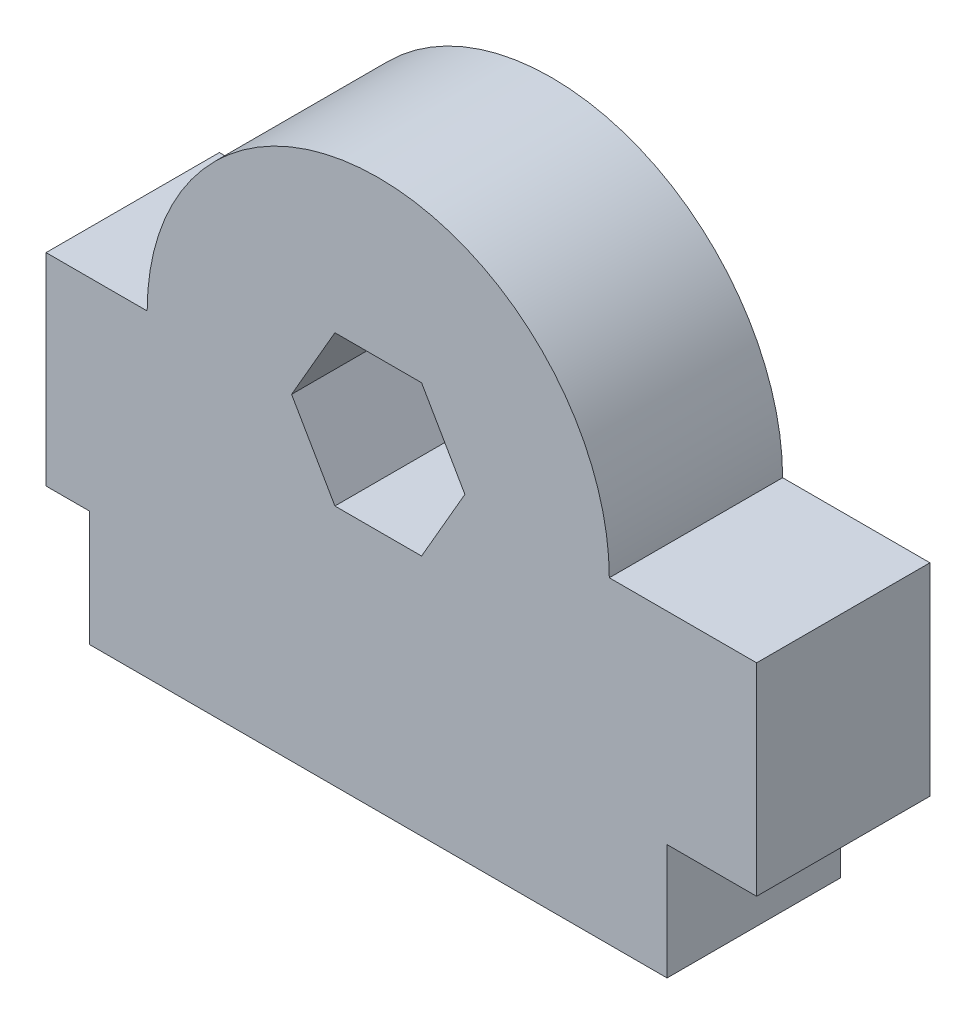
ISO-10303-21;
HEADER;
FILE_DESCRIPTION(('STEP AP214'),'2;1');
FILE_NAME('part.step','',(''),(''),'','','');
FILE_SCHEMA(('AUTOMOTIVE_DESIGN { 1 0 10303 214 1 1 1 1 }'));
ENDSEC;
DATA;
#1=APPLICATION_CONTEXT('core data for automotive mechanical design processes');
#2=APPLICATION_PROTOCOL_DEFINITION('international standard','automotive_design',2000,#1);
#3=PRODUCT_CONTEXT('',#1,'mechanical');
#4=PRODUCT('Part','Part','',(#3));
#5=PRODUCT_RELATED_PRODUCT_CATEGORY('part','',(#4));
#6=PRODUCT_DEFINITION_FORMATION('','',#4);
#7=PRODUCT_DEFINITION_CONTEXT('part definition',#1,'design');
#8=PRODUCT_DEFINITION('design','',#6,#7);
#9=PRODUCT_DEFINITION_SHAPE('','',#8);
#10=(LENGTH_UNIT() NAMED_UNIT(*) SI_UNIT(.MILLI.,.METRE.));
#11=(NAMED_UNIT(*) PLANE_ANGLE_UNIT() SI_UNIT($,.RADIAN.));
#12=(NAMED_UNIT(*) SI_UNIT($,.STERADIAN.) SOLID_ANGLE_UNIT());
#13=UNCERTAINTY_MEASURE_WITH_UNIT(LENGTH_MEASURE(1.E-05),#10,'distance_accuracy_value','');
#14=(GEOMETRIC_REPRESENTATION_CONTEXT(3) GLOBAL_UNCERTAINTY_ASSIGNED_CONTEXT((#13)) GLOBAL_UNIT_ASSIGNED_CONTEXT((#10,
#11,#12)) REPRESENTATION_CONTEXT('',''));
#15=CARTESIAN_POINT('',(0.,0.,0.));
#16=DIRECTION('',(0.,0.,1.));
#17=DIRECTION('',(1.,0.,0.));
#18=AXIS2_PLACEMENT_3D('',#15,#16,#17);
#19=CARTESIAN_POINT('',(10.,11.,6.));
#20=DIRECTION('',(0.,0.,1.));
#21=DIRECTION('',(1.,0.,0.));
#22=AXIS2_PLACEMENT_3D('',#19,#20,#21);
#23=PLANE('',#22);
#24=DIRECTION('',(0.,-1.,0.));
#25=VECTOR('',#24,1.);
#26=CARTESIAN_POINT('',(0.,0.,6.));
#27=LINE('',#26,#25);
#28=CARTESIAN_POINT('',(0.,4.,6.));
#29=VERTEX_POINT('',#28);
#30=CARTESIAN_POINT('',(0.,0.,6.));
#31=VERTEX_POINT('',#30);
#32=EDGE_CURVE('E197',#29,#31,#27,.T.);
#33=ORIENTED_EDGE('',*,*,#32,.T.);
#34=DIRECTION('',(1.,0.,0.));
#35=VECTOR('',#34,1.);
#36=CARTESIAN_POINT('',(0.,0.,6.));
#37=LINE('',#36,#35);
#38=CARTESIAN_POINT('',(20.,0.,6.));
#39=VERTEX_POINT('',#38);
#40=EDGE_CURVE('E200',#31,#39,#37,.T.);
#41=ORIENTED_EDGE('',*,*,#40,.T.);
#42=DIRECTION('',(0.,1.,0.));
#43=VECTOR('',#42,1.);
#44=CARTESIAN_POINT('',(20.,0.,6.));
#45=LINE('',#44,#43);
#46=CARTESIAN_POINT('',(20.,4.,6.));
#47=VERTEX_POINT('',#46);
#48=EDGE_CURVE('E203',#39,#47,#45,.T.);
#49=ORIENTED_EDGE('',*,*,#48,.T.);
#50=DIRECTION('',(1.,0.,0.));
#51=VECTOR('',#50,1.);
#52=CARTESIAN_POINT('',(23.1,4.,6.));
#53=LINE('',#52,#51);
#54=CARTESIAN_POINT('',(23.1,4.,6.));
#55=VERTEX_POINT('',#54);
#56=EDGE_CURVE('E205',#47,#55,#53,.T.);
#57=ORIENTED_EDGE('',*,*,#56,.T.);
#58=DIRECTION('',(0.,1.,0.));
#59=VECTOR('',#58,1.);
#60=CARTESIAN_POINT('',(23.1,11.,6.));
#61=LINE('',#60,#59);
#62=CARTESIAN_POINT('',(23.1,11.,6.));
#63=VERTEX_POINT('',#62);
#64=EDGE_CURVE('E207',#55,#63,#61,.T.);
#65=ORIENTED_EDGE('',*,*,#64,.T.);
#66=DIRECTION('',(-1.,0.,0.));
#67=VECTOR('',#66,1.);
#68=CARTESIAN_POINT('',(18.,11.,6.));
#69=LINE('',#68,#67);
#70=CARTESIAN_POINT('',(18.,11.,6.));
#71=VERTEX_POINT('',#70);
#72=EDGE_CURVE('E209',#63,#71,#69,.T.);
#73=ORIENTED_EDGE('',*,*,#72,.T.);
#74=CARTESIAN_POINT('',(10.,11.,6.));
#75=DIRECTION('',(0.,0.,1.));
#76=DIRECTION('',(1.,0.,0.));
#77=AXIS2_PLACEMENT_3D('',#74,#75,#76);
#78=CIRCLE('',#77,8.);
#79=CARTESIAN_POINT('',(2.,11.,6.));
#80=VERTEX_POINT('',#79);
#81=EDGE_CURVE('E211',#71,#80,#78,.T.);
#82=ORIENTED_EDGE('',*,*,#81,.T.);
#83=DIRECTION('',(-1.,0.,0.));
#84=VECTOR('',#83,1.);
#85=CARTESIAN_POINT('',(-1.5,11.,6.));
#86=LINE('',#85,#84);
#87=CARTESIAN_POINT('',(-1.5,11.,6.));
#88=VERTEX_POINT('',#87);
#89=EDGE_CURVE('E213',#80,#88,#86,.T.);
#90=ORIENTED_EDGE('',*,*,#89,.T.);
#91=DIRECTION('',(0.,-1.,0.));
#92=VECTOR('',#91,1.);
#93=CARTESIAN_POINT('',(-1.5,4.,6.));
#94=LINE('',#93,#92);
#95=CARTESIAN_POINT('',(-1.5,4.,6.));
#96=VERTEX_POINT('',#95);
#97=EDGE_CURVE('E215',#88,#96,#94,.T.);
#98=ORIENTED_EDGE('',*,*,#97,.T.);
#99=DIRECTION('',(1.,0.,0.));
#100=VECTOR('',#99,1.);
#101=CARTESIAN_POINT('',(0.,4.,6.));
#102=LINE('',#101,#100);
#103=EDGE_CURVE('E217',#96,#29,#102,.T.);
#104=ORIENTED_EDGE('',*,*,#103,.T.);
#105=EDGE_LOOP('',(#33,#41,#49,#57,#65,#73,#82,#90,#98,#104));
#106=FACE_BOUND('',#105,.T.);
#107=DIRECTION('',(-0.500000000000001,0.866025403784438,0.));
#108=VECTOR('',#107,1.);
#109=CARTESIAN_POINT('',(13.,11.,6.));
#110=LINE('',#109,#108);
#111=CARTESIAN_POINT('',(13.,11.,6.));
#112=VERTEX_POINT('',#111);
#113=CARTESIAN_POINT('',(11.5,13.5980762113533,6.));
#114=VERTEX_POINT('',#113);
#115=EDGE_CURVE('E154',#112,#114,#110,.T.);
#116=ORIENTED_EDGE('',*,*,#115,.F.);
#117=DIRECTION('',(0.499999999999995,0.866025403784441,0.));
#118=VECTOR('',#117,1.);
#119=CARTESIAN_POINT('',(11.5,8.4019237886467,6.));
#120=LINE('',#119,#118);
#121=CARTESIAN_POINT('',(11.5,8.4019237886467,6.));
#122=VERTEX_POINT('',#121);
#123=EDGE_CURVE('E146',#122,#112,#120,.T.);
#124=ORIENTED_EDGE('',*,*,#123,.F.);
#125=DIRECTION('',(1.,0.,0.));
#126=VECTOR('',#125,1.);
#127=CARTESIAN_POINT('',(8.50000000000002,8.40192378864667,6.));
#128=LINE('',#127,#126);
#129=CARTESIAN_POINT('',(8.50000000000002,8.40192378864667,6.));
#130=VERTEX_POINT('',#129);
#131=EDGE_CURVE('E175',#130,#122,#128,.T.);
#132=ORIENTED_EDGE('',*,*,#131,.F.);
#133=DIRECTION('',(0.500000000000007,-0.866025403784435,0.));
#134=VECTOR('',#133,1.);
#135=CARTESIAN_POINT('',(7.,11.,6.));
#136=LINE('',#135,#134);
#137=CARTESIAN_POINT('',(7.,11.,6.));
#138=VERTEX_POINT('',#137);
#139=EDGE_CURVE('E173',#138,#130,#136,.T.);
#140=ORIENTED_EDGE('',*,*,#139,.F.);
#141=DIRECTION('',(-0.499999999999995,-0.866025403784441,0.));
#142=VECTOR('',#141,1.);
#143=CARTESIAN_POINT('',(8.49999999999999,13.5980762113533,6.));
#144=LINE('',#143,#142);
#145=CARTESIAN_POINT('',(8.49999999999999,13.5980762113533,6.));
#146=VERTEX_POINT('',#145);
#147=EDGE_CURVE('E169',#146,#138,#144,.T.);
#148=ORIENTED_EDGE('',*,*,#147,.F.);
#149=DIRECTION('',(-1.,0.,0.));
#150=VECTOR('',#149,1.);
#151=CARTESIAN_POINT('',(11.5,13.5980762113533,6.));
#152=LINE('',#151,#150);
#153=EDGE_CURVE('E167',#114,#146,#152,.T.);
#154=ORIENTED_EDGE('',*,*,#153,.F.);
#155=EDGE_LOOP('',(#116,#124,#132,#140,#148,#154));
#156=FACE_BOUND('',#155,.T.);
#157=ADVANCED_FACE('F33',(#106,#156),#23,.T.);
#158=CARTESIAN_POINT('',(10.,11.,0.));
#159=DIRECTION('',(0.,0.,1.));
#160=DIRECTION('',(1.,0.,0.));
#161=AXIS2_PLACEMENT_3D('',#158,#159,#160);
#162=PLANE('',#161);
#163=DIRECTION('',(0.,-1.,0.));
#164=VECTOR('',#163,1.);
#165=CARTESIAN_POINT('',(0.,0.,0.));
#166=LINE('',#165,#164);
#167=CARTESIAN_POINT('',(0.,4.,0.));
#168=VERTEX_POINT('',#167);
#169=CARTESIAN_POINT('',(0.,0.,0.));
#170=VERTEX_POINT('',#169);
#171=EDGE_CURVE('E162',#168,#170,#166,.T.);
#172=ORIENTED_EDGE('',*,*,#171,.F.);
#173=DIRECTION('',(1.,0.,0.));
#174=VECTOR('',#173,1.);
#175=CARTESIAN_POINT('',(0.,4.,0.));
#176=LINE('',#175,#174);
#177=CARTESIAN_POINT('',(-1.5,4.,0.));
#178=VERTEX_POINT('',#177);
#179=EDGE_CURVE('E201',#178,#168,#176,.T.);
#180=ORIENTED_EDGE('',*,*,#179,.F.);
#181=DIRECTION('',(0.,-1.,0.));
#182=VECTOR('',#181,1.);
#183=CARTESIAN_POINT('',(-1.5,4.,0.));
#184=LINE('',#183,#182);
#185=CARTESIAN_POINT('',(-1.5,11.,0.));
#186=VERTEX_POINT('',#185);
#187=EDGE_CURVE('E236',#186,#178,#184,.T.);
#188=ORIENTED_EDGE('',*,*,#187,.F.);
#189=DIRECTION('',(-1.,0.,0.));
#190=VECTOR('',#189,1.);
#191=CARTESIAN_POINT('',(-1.5,11.,0.));
#192=LINE('',#191,#190);
#193=CARTESIAN_POINT('',(2.,11.,0.));
#194=VERTEX_POINT('',#193);
#195=EDGE_CURVE('E234',#194,#186,#192,.T.);
#196=ORIENTED_EDGE('',*,*,#195,.F.);
#197=CARTESIAN_POINT('',(10.,11.,0.));
#198=DIRECTION('',(0.,0.,1.));
#199=DIRECTION('',(1.,0.,0.));
#200=AXIS2_PLACEMENT_3D('',#197,#198,#199);
#201=CIRCLE('',#200,8.);
#202=CARTESIAN_POINT('',(18.,11.,0.));
#203=VERTEX_POINT('',#202);
#204=EDGE_CURVE('E232',#203,#194,#201,.T.);
#205=ORIENTED_EDGE('',*,*,#204,.F.);
#206=DIRECTION('',(-1.,0.,0.));
#207=VECTOR('',#206,1.);
#208=CARTESIAN_POINT('',(18.,11.,0.));
#209=LINE('',#208,#207);
#210=CARTESIAN_POINT('',(23.1,11.,0.));
#211=VERTEX_POINT('',#210);
#212=EDGE_CURVE('E230',#211,#203,#209,.T.);
#213=ORIENTED_EDGE('',*,*,#212,.F.);
#214=DIRECTION('',(0.,1.,0.));
#215=VECTOR('',#214,1.);
#216=CARTESIAN_POINT('',(23.1,11.,0.));
#217=LINE('',#216,#215);
#218=CARTESIAN_POINT('',(23.1,4.,0.));
#219=VERTEX_POINT('',#218);
#220=EDGE_CURVE('E228',#219,#211,#217,.T.);
#221=ORIENTED_EDGE('',*,*,#220,.F.);
#222=DIRECTION('',(1.,0.,0.));
#223=VECTOR('',#222,1.);
#224=CARTESIAN_POINT('',(23.1,4.,0.));
#225=LINE('',#224,#223);
#226=CARTESIAN_POINT('',(20.,4.,0.));
#227=VERTEX_POINT('',#226);
#228=EDGE_CURVE('E226',#227,#219,#225,.T.);
#229=ORIENTED_EDGE('',*,*,#228,.F.);
#230=DIRECTION('',(0.,1.,0.));
#231=VECTOR('',#230,1.);
#232=CARTESIAN_POINT('',(20.,0.,0.));
#233=LINE('',#232,#231);
#234=CARTESIAN_POINT('',(20.,0.,0.));
#235=VERTEX_POINT('',#234);
#236=EDGE_CURVE('E224',#235,#227,#233,.T.);
#237=ORIENTED_EDGE('',*,*,#236,.F.);
#238=DIRECTION('',(1.,0.,0.));
#239=VECTOR('',#238,1.);
#240=CARTESIAN_POINT('',(0.,0.,0.));
#241=LINE('',#240,#239);
#242=EDGE_CURVE('E222',#170,#235,#241,.T.);
#243=ORIENTED_EDGE('',*,*,#242,.F.);
#244=EDGE_LOOP('',(#172,#180,#188,#196,#205,#213,#221,#229,#237,#243));
#245=FACE_BOUND('',#244,.T.);
#246=DIRECTION('',(0.499999999999995,0.866025403784441,0.));
#247=VECTOR('',#246,1.);
#248=CARTESIAN_POINT('',(11.5,8.4019237886467,0.));
#249=LINE('',#248,#247);
#250=CARTESIAN_POINT('',(11.5,8.4019237886467,0.));
#251=VERTEX_POINT('',#250);
#252=CARTESIAN_POINT('',(13.,11.,0.));
#253=VERTEX_POINT('',#252);
#254=EDGE_CURVE('E56',#251,#253,#249,.T.);
#255=ORIENTED_EDGE('',*,*,#254,.T.);
#256=DIRECTION('',(-0.500000000000001,0.866025403784438,0.));
#257=VECTOR('',#256,1.);
#258=CARTESIAN_POINT('',(13.,11.,0.));
#259=LINE('',#258,#257);
#260=CARTESIAN_POINT('',(11.5,13.5980762113533,0.));
#261=VERTEX_POINT('',#260);
#262=EDGE_CURVE('E161',#253,#261,#259,.T.);
#263=ORIENTED_EDGE('',*,*,#262,.T.);
#264=DIRECTION('',(-1.,0.,0.));
#265=VECTOR('',#264,1.);
#266=CARTESIAN_POINT('',(11.5,13.5980762113533,0.));
#267=LINE('',#266,#265);
#268=CARTESIAN_POINT('',(8.49999999999999,13.5980762113533,0.));
#269=VERTEX_POINT('',#268);
#270=EDGE_CURVE('E179',#261,#269,#267,.T.);
#271=ORIENTED_EDGE('',*,*,#270,.T.);
#272=DIRECTION('',(-0.499999999999995,-0.866025403784441,0.));
#273=VECTOR('',#272,1.);
#274=CARTESIAN_POINT('',(8.49999999999999,13.5980762113533,0.));
#275=LINE('',#274,#273);
#276=CARTESIAN_POINT('',(7.,11.,0.));
#277=VERTEX_POINT('',#276);
#278=EDGE_CURVE('E182',#269,#277,#275,.T.);
#279=ORIENTED_EDGE('',*,*,#278,.T.);
#280=DIRECTION('',(0.500000000000007,-0.866025403784435,0.));
#281=VECTOR('',#280,1.);
#282=CARTESIAN_POINT('',(7.,11.,0.));
#283=LINE('',#282,#281);
#284=CARTESIAN_POINT('',(8.50000000000002,8.40192378864667,0.));
#285=VERTEX_POINT('',#284);
#286=EDGE_CURVE('E185',#277,#285,#283,.T.);
#287=ORIENTED_EDGE('',*,*,#286,.T.);
#288=DIRECTION('',(1.,0.,0.));
#289=VECTOR('',#288,1.);
#290=CARTESIAN_POINT('',(8.50000000000002,8.40192378864667,0.));
#291=LINE('',#290,#289);
#292=EDGE_CURVE('E155',#285,#251,#291,.T.);
#293=ORIENTED_EDGE('',*,*,#292,.T.);
#294=EDGE_LOOP('',(#255,#263,#271,#279,#287,#293));
#295=FACE_BOUND('',#294,.T.);
#296=ADVANCED_FACE('F272',(#245,#295),#162,.F.);
#297=CARTESIAN_POINT('',(0.,0.,6.));
#298=DIRECTION('',(1.,0.,0.));
#299=DIRECTION('',(0.,0.,-1.));
#300=AXIS2_PLACEMENT_3D('',#297,#298,#299);
#301=PLANE('',#300);
#302=ORIENTED_EDGE('',*,*,#171,.T.);
#303=DIRECTION('',(0.,0.,-1.));
#304=VECTOR('',#303,1.);
#305=CARTESIAN_POINT('',(0.,0.,6.));
#306=LINE('',#305,#304);
#307=EDGE_CURVE('E11',#31,#170,#306,.T.);
#308=ORIENTED_EDGE('',*,*,#307,.F.);
#309=ORIENTED_EDGE('',*,*,#32,.F.);
#310=DIRECTION('',(0.,0.,-1.));
#311=VECTOR('',#310,1.);
#312=CARTESIAN_POINT('',(0.,4.,6.));
#313=LINE('',#312,#311);
#314=EDGE_CURVE('E219',#29,#168,#313,.T.);
#315=ORIENTED_EDGE('',*,*,#314,.T.);
#316=EDGE_LOOP('',(#302,#308,#309,#315));
#317=FACE_BOUND('',#316,.T.);
#318=ADVANCED_FACE('F35',(#317),#301,.F.);
#319=CARTESIAN_POINT('',(0.,0.,6.));
#320=DIRECTION('',(0.,1.,0.));
#321=DIRECTION('',(0.,0.,1.));
#322=AXIS2_PLACEMENT_3D('',#319,#320,#321);
#323=PLANE('',#322);
#324=ORIENTED_EDGE('',*,*,#242,.T.);
#325=DIRECTION('',(0.,0.,-1.));
#326=VECTOR('',#325,1.);
#327=CARTESIAN_POINT('',(20.,0.,6.));
#328=LINE('',#327,#326);
#329=EDGE_CURVE('E41',#39,#235,#328,.T.);
#330=ORIENTED_EDGE('',*,*,#329,.F.);
#331=ORIENTED_EDGE('',*,*,#40,.F.);
#332=ORIENTED_EDGE('',*,*,#307,.T.);
#333=EDGE_LOOP('',(#324,#330,#331,#332));
#334=FACE_BOUND('',#333,.T.);
#335=ADVANCED_FACE('F289',(#334),#323,.F.);
#336=CARTESIAN_POINT('',(20.,0.,6.));
#337=DIRECTION('',(-1.,0.,0.));
#338=DIRECTION('',(0.,0.,1.));
#339=AXIS2_PLACEMENT_3D('',#336,#337,#338);
#340=PLANE('',#339);
#341=ORIENTED_EDGE('',*,*,#236,.T.);
#342=DIRECTION('',(0.,0.,-1.));
#343=VECTOR('',#342,1.);
#344=CARTESIAN_POINT('',(20.,4.,6.));
#345=LINE('',#344,#343);
#346=EDGE_CURVE('E259',#47,#227,#345,.T.);
#347=ORIENTED_EDGE('',*,*,#346,.F.);
#348=ORIENTED_EDGE('',*,*,#48,.F.);
#349=ORIENTED_EDGE('',*,*,#329,.T.);
#350=EDGE_LOOP('',(#341,#347,#348,#349));
#351=FACE_BOUND('',#350,.T.);
#352=ADVANCED_FACE('F266',(#351),#340,.F.);
#353=CARTESIAN_POINT('',(23.1,4.,6.));
#354=DIRECTION('',(0.,1.,0.));
#355=DIRECTION('',(-1.,0.,0.));
#356=AXIS2_PLACEMENT_3D('',#353,#354,#355);
#357=PLANE('',#356);
#358=ORIENTED_EDGE('',*,*,#228,.T.);
#359=DIRECTION('',(0.,0.,-1.));
#360=VECTOR('',#359,1.);
#361=CARTESIAN_POINT('',(23.1,4.,6.));
#362=LINE('',#361,#360);
#363=EDGE_CURVE('E256',#55,#219,#362,.T.);
#364=ORIENTED_EDGE('',*,*,#363,.F.);
#365=ORIENTED_EDGE('',*,*,#56,.F.);
#366=ORIENTED_EDGE('',*,*,#346,.T.);
#367=EDGE_LOOP('',(#358,#364,#365,#366));
#368=FACE_BOUND('',#367,.T.);
#369=ADVANCED_FACE('F278',(#368),#357,.F.);
#370=CARTESIAN_POINT('',(23.1,11.,6.));
#371=DIRECTION('',(-1.,0.,0.));
#372=DIRECTION('',(0.,0.,1.));
#373=AXIS2_PLACEMENT_3D('',#370,#371,#372);
#374=PLANE('',#373);
#375=ORIENTED_EDGE('',*,*,#220,.T.);
#376=DIRECTION('',(0.,0.,-1.));
#377=VECTOR('',#376,1.);
#378=CARTESIAN_POINT('',(23.1,11.,6.));
#379=LINE('',#378,#377);
#380=EDGE_CURVE('E253',#63,#211,#379,.T.);
#381=ORIENTED_EDGE('',*,*,#380,.F.);
#382=ORIENTED_EDGE('',*,*,#64,.F.);
#383=ORIENTED_EDGE('',*,*,#363,.T.);
#384=EDGE_LOOP('',(#375,#381,#382,#383));
#385=FACE_BOUND('',#384,.T.);
#386=ADVANCED_FACE('F282',(#385),#374,.F.);
#387=CARTESIAN_POINT('',(18.,11.,6.));
#388=DIRECTION('',(0.,-1.,0.));
#389=DIRECTION('',(1.,0.,0.));
#390=AXIS2_PLACEMENT_3D('',#387,#388,#389);
#391=PLANE('',#390);
#392=ORIENTED_EDGE('',*,*,#212,.T.);
#393=DIRECTION('',(0.,0.,-1.));
#394=VECTOR('',#393,1.);
#395=CARTESIAN_POINT('',(18.,11.,6.));
#396=LINE('',#395,#394);
#397=EDGE_CURVE('E250',#71,#203,#396,.T.);
#398=ORIENTED_EDGE('',*,*,#397,.F.);
#399=ORIENTED_EDGE('',*,*,#72,.F.);
#400=ORIENTED_EDGE('',*,*,#380,.T.);
#401=EDGE_LOOP('',(#392,#398,#399,#400));
#402=FACE_BOUND('',#401,.T.);
#403=ADVANCED_FACE('F312',(#402),#391,.F.);
#404=CARTESIAN_POINT('',(10.,11.,6.));
#405=DIRECTION('',(0.,0.,-1.));
#406=DIRECTION('',(-1.,0.,0.));
#407=AXIS2_PLACEMENT_3D('',#404,#405,#406);
#408=CYLINDRICAL_SURFACE('',#407,8.);
#409=ORIENTED_EDGE('',*,*,#204,.T.);
#410=DIRECTION('',(0.,0.,-1.));
#411=VECTOR('',#410,1.);
#412=CARTESIAN_POINT('',(2.,11.,6.));
#413=LINE('',#412,#411);
#414=EDGE_CURVE('E247',#80,#194,#413,.T.);
#415=ORIENTED_EDGE('',*,*,#414,.F.);
#416=ORIENTED_EDGE('',*,*,#81,.F.);
#417=ORIENTED_EDGE('',*,*,#397,.T.);
#418=EDGE_LOOP('',(#409,#415,#416,#417));
#419=FACE_BOUND('',#418,.T.);
#420=ADVANCED_FACE('F309',(#419),#408,.T.);
#421=CARTESIAN_POINT('',(-1.5,11.,6.));
#422=DIRECTION('',(0.,-1.,0.));
#423=DIRECTION('',(0.,0.,-1.));
#424=AXIS2_PLACEMENT_3D('',#421,#422,#423);
#425=PLANE('',#424);
#426=ORIENTED_EDGE('',*,*,#195,.T.);
#427=DIRECTION('',(0.,0.,-1.));
#428=VECTOR('',#427,1.);
#429=CARTESIAN_POINT('',(-1.5,11.,6.));
#430=LINE('',#429,#428);
#431=EDGE_CURVE('E244',#88,#186,#430,.T.);
#432=ORIENTED_EDGE('',*,*,#431,.F.);
#433=ORIENTED_EDGE('',*,*,#89,.F.);
#434=ORIENTED_EDGE('',*,*,#414,.T.);
#435=EDGE_LOOP('',(#426,#432,#433,#434));
#436=FACE_BOUND('',#435,.T.);
#437=ADVANCED_FACE('F305',(#436),#425,.F.);
#438=CARTESIAN_POINT('',(-1.5,4.,6.));
#439=DIRECTION('',(1.,0.,0.));
#440=DIRECTION('',(0.,0.,-1.));
#441=AXIS2_PLACEMENT_3D('',#438,#439,#440);
#442=PLANE('',#441);
#443=ORIENTED_EDGE('',*,*,#187,.T.);
#444=DIRECTION('',(0.,0.,-1.));
#445=VECTOR('',#444,1.);
#446=CARTESIAN_POINT('',(-1.5,4.,6.));
#447=LINE('',#446,#445);
#448=EDGE_CURVE('E241',#96,#178,#447,.T.);
#449=ORIENTED_EDGE('',*,*,#448,.F.);
#450=ORIENTED_EDGE('',*,*,#97,.F.);
#451=ORIENTED_EDGE('',*,*,#431,.T.);
#452=EDGE_LOOP('',(#443,#449,#450,#451));
#453=FACE_BOUND('',#452,.T.);
#454=ADVANCED_FACE('F301',(#453),#442,.F.);
#455=CARTESIAN_POINT('',(0.,4.,6.));
#456=DIRECTION('',(0.,1.,0.));
#457=DIRECTION('',(0.,0.,1.));
#458=AXIS2_PLACEMENT_3D('',#455,#456,#457);
#459=PLANE('',#458);
#460=ORIENTED_EDGE('',*,*,#179,.T.);
#461=ORIENTED_EDGE('',*,*,#314,.F.);
#462=ORIENTED_EDGE('',*,*,#103,.F.);
#463=ORIENTED_EDGE('',*,*,#448,.T.);
#464=EDGE_LOOP('',(#460,#461,#462,#463));
#465=FACE_BOUND('',#464,.T.);
#466=ADVANCED_FACE('F296',(#465),#459,.F.);
#467=CARTESIAN_POINT('',(11.5,8.4019237886467,6.));
#468=DIRECTION('',(-0.866025403784442,0.499999999999995,0.));
#469=DIRECTION('',(-0.499999999999995,-0.866025403784442,0.));
#470=AXIS2_PLACEMENT_3D('',#467,#468,#469);
#471=PLANE('',#470);
#472=ORIENTED_EDGE('',*,*,#254,.F.);
#473=DIRECTION('',(0.,0.,-1.));
#474=VECTOR('',#473,1.);
#475=CARTESIAN_POINT('',(11.5,8.4019237886467,6.));
#476=LINE('',#475,#474);
#477=EDGE_CURVE('E150',#122,#251,#476,.T.);
#478=ORIENTED_EDGE('',*,*,#477,.F.);
#479=ORIENTED_EDGE('',*,*,#123,.T.);
#480=DIRECTION('',(0.,0.,-1.));
#481=VECTOR('',#480,1.);
#482=CARTESIAN_POINT('',(13.,11.,6.));
#483=LINE('',#482,#481);
#484=EDGE_CURVE('E149',#112,#253,#483,.T.);
#485=ORIENTED_EDGE('',*,*,#484,.T.);
#486=EDGE_LOOP('',(#472,#478,#479,#485));
#487=FACE_BOUND('',#486,.T.);
#488=ADVANCED_FACE('F148',(#487),#471,.T.);
#489=CARTESIAN_POINT('',(13.,11.,6.));
#490=DIRECTION('',(-0.866025403784438,-0.500000000000001,0.));
#491=DIRECTION('',(0.500000000000001,-0.866025403784438,0.));
#492=AXIS2_PLACEMENT_3D('',#489,#490,#491);
#493=PLANE('',#492);
#494=ORIENTED_EDGE('',*,*,#262,.F.);
#495=ORIENTED_EDGE('',*,*,#484,.F.);
#496=ORIENTED_EDGE('',*,*,#115,.T.);
#497=DIRECTION('',(0.,0.,-1.));
#498=VECTOR('',#497,1.);
#499=CARTESIAN_POINT('',(11.5,13.5980762113533,6.));
#500=LINE('',#499,#498);
#501=EDGE_CURVE('E163',#114,#261,#500,.T.);
#502=ORIENTED_EDGE('',*,*,#501,.T.);
#503=EDGE_LOOP('',(#494,#495,#496,#502));
#504=FACE_BOUND('',#503,.T.);
#505=ADVANCED_FACE('F158',(#504),#493,.T.);
#506=CARTESIAN_POINT('',(11.5,13.5980762113533,6.));
#507=DIRECTION('',(0.,-1.,0.));
#508=DIRECTION('',(1.,0.,0.));
#509=AXIS2_PLACEMENT_3D('',#506,#507,#508);
#510=PLANE('',#509);
#511=ORIENTED_EDGE('',*,*,#270,.F.);
#512=ORIENTED_EDGE('',*,*,#501,.F.);
#513=ORIENTED_EDGE('',*,*,#153,.T.);
#514=DIRECTION('',(0.,0.,-1.));
#515=VECTOR('',#514,1.);
#516=CARTESIAN_POINT('',(8.49999999999999,13.5980762113533,6.));
#517=LINE('',#516,#515);
#518=EDGE_CURVE('E194',#146,#269,#517,.T.);
#519=ORIENTED_EDGE('',*,*,#518,.T.);
#520=EDGE_LOOP('',(#511,#512,#513,#519));
#521=FACE_BOUND('',#520,.T.);
#522=ADVANCED_FACE('F358',(#521),#510,.T.);
#523=CARTESIAN_POINT('',(8.49999999999999,13.5980762113533,6.));
#524=DIRECTION('',(0.866025403784441,-0.499999999999995,0.));
#525=DIRECTION('',(0.499999999999995,0.866025403784441,0.));
#526=AXIS2_PLACEMENT_3D('',#523,#524,#525);
#527=PLANE('',#526);
#528=ORIENTED_EDGE('',*,*,#278,.F.);
#529=ORIENTED_EDGE('',*,*,#518,.F.);
#530=ORIENTED_EDGE('',*,*,#147,.T.);
#531=DIRECTION('',(0.,0.,-1.));
#532=VECTOR('',#531,1.);
#533=CARTESIAN_POINT('',(7.,11.,6.));
#534=LINE('',#533,#532);
#535=EDGE_CURVE('E192',#138,#277,#534,.T.);
#536=ORIENTED_EDGE('',*,*,#535,.T.);
#537=EDGE_LOOP('',(#528,#529,#530,#536));
#538=FACE_BOUND('',#537,.T.);
#539=ADVANCED_FACE('F364',(#538),#527,.T.);
#540=CARTESIAN_POINT('',(7.,11.,6.));
#541=DIRECTION('',(0.866025403784435,0.500000000000007,0.));
#542=DIRECTION('',(-0.500000000000007,0.866025403784435,0.));
#543=AXIS2_PLACEMENT_3D('',#540,#541,#542);
#544=PLANE('',#543);
#545=ORIENTED_EDGE('',*,*,#286,.F.);
#546=ORIENTED_EDGE('',*,*,#535,.F.);
#547=ORIENTED_EDGE('',*,*,#139,.T.);
#548=DIRECTION('',(0.,0.,-1.));
#549=VECTOR('',#548,1.);
#550=CARTESIAN_POINT('',(8.50000000000002,8.40192378864667,6.));
#551=LINE('',#550,#549);
#552=EDGE_CURVE('E48',#130,#285,#551,.T.);
#553=ORIENTED_EDGE('',*,*,#552,.T.);
#554=EDGE_LOOP('',(#545,#546,#547,#553));
#555=FACE_BOUND('',#554,.T.);
#556=ADVANCED_FACE('F372',(#555),#544,.T.);
#557=CARTESIAN_POINT('',(8.50000000000002,8.40192378864667,6.));
#558=DIRECTION('',(0.,1.,0.));
#559=DIRECTION('',(-1.,0.,0.));
#560=AXIS2_PLACEMENT_3D('',#557,#558,#559);
#561=PLANE('',#560);
#562=ORIENTED_EDGE('',*,*,#292,.F.);
#563=ORIENTED_EDGE('',*,*,#552,.F.);
#564=ORIENTED_EDGE('',*,*,#131,.T.);
#565=ORIENTED_EDGE('',*,*,#477,.T.);
#566=EDGE_LOOP('',(#562,#563,#564,#565));
#567=FACE_BOUND('',#566,.T.);
#568=ADVANCED_FACE('F380',(#567),#561,.T.);
#569=CLOSED_SHELL('',(#157,#296,#318,#335,#352,#369,#386,#403,#420,#437,#454,#466,#488,#505,
#522,#539,#556,#568));
#570=MANIFOLD_SOLID_BREP('B2',#569);
#571=ADVANCED_BREP_SHAPE_REPRESENTATION('',(#18,#570),#14);
#572=SHAPE_DEFINITION_REPRESENTATION(#9,#571);
ENDSEC;
END-ISO-10303-21;
